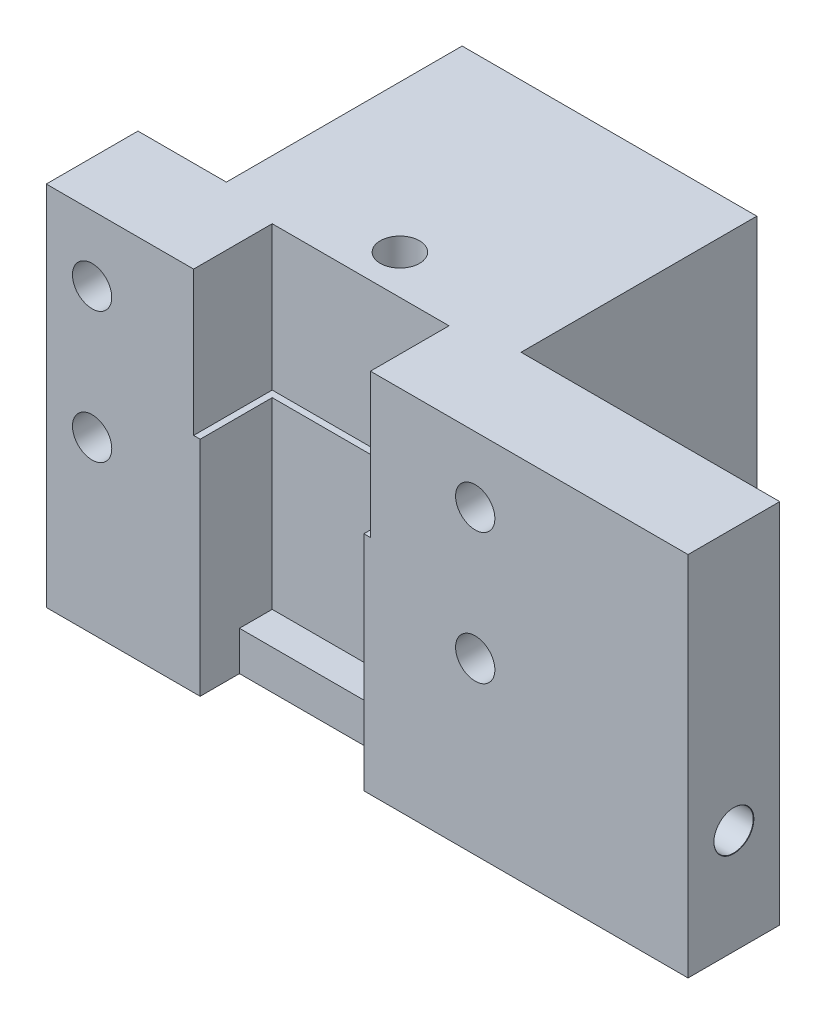
ISO-10303-21;
HEADER;
FILE_DESCRIPTION(('STEP AP214'),'2;1');
FILE_NAME('part.step','',(''),(''),'','','');
FILE_SCHEMA(('AUTOMOTIVE_DESIGN { 1 0 10303 214 1 1 1 1 }'));
ENDSEC;
DATA;
#1=APPLICATION_CONTEXT('core data for automotive mechanical design processes');
#2=APPLICATION_PROTOCOL_DEFINITION('international standard','automotive_design',2000,#1);
#3=PRODUCT_CONTEXT('',#1,'mechanical');
#4=PRODUCT('Part','Part','',(#3));
#5=PRODUCT_RELATED_PRODUCT_CATEGORY('part','',(#4));
#6=PRODUCT_DEFINITION_FORMATION('','',#4);
#7=PRODUCT_DEFINITION_CONTEXT('part definition',#1,'design');
#8=PRODUCT_DEFINITION('design','',#6,#7);
#9=PRODUCT_DEFINITION_SHAPE('','',#8);
#10=(LENGTH_UNIT() NAMED_UNIT(*) SI_UNIT(.MILLI.,.METRE.));
#11=(NAMED_UNIT(*) PLANE_ANGLE_UNIT() SI_UNIT($,.RADIAN.));
#12=(NAMED_UNIT(*) SI_UNIT($,.STERADIAN.) SOLID_ANGLE_UNIT());
#13=UNCERTAINTY_MEASURE_WITH_UNIT(LENGTH_MEASURE(1.E-05),#10,'distance_accuracy_value','');
#14=(GEOMETRIC_REPRESENTATION_CONTEXT(3) GLOBAL_UNCERTAINTY_ASSIGNED_CONTEXT((#13)) GLOBAL_UNIT_ASSIGNED_CONTEXT((#10,
#11,#12)) REPRESENTATION_CONTEXT('',''));
#15=CARTESIAN_POINT('',(0.,0.,0.));
#16=DIRECTION('',(0.,0.,1.));
#17=DIRECTION('',(1.,0.,0.));
#18=AXIS2_PLACEMENT_3D('',#15,#16,#17);
#19=CARTESIAN_POINT('',(1.22442804428043,3.,12.690405904059));
#20=DIRECTION('',(-1.,0.,0.));
#21=DIRECTION('',(0.,0.,1.));
#22=AXIS2_PLACEMENT_3D('',#19,#20,#21);
#23=PLANE('',#22);
#24=DIRECTION('',(0.,0.,-1.));
#25=VECTOR('',#24,1.);
#26=CARTESIAN_POINT('',(1.22442804428043,17.,7.19040590405904));
#27=LINE('',#26,#25);
#28=CARTESIAN_POINT('',(1.22442804428043,17.,12.690405904059));
#29=VERTEX_POINT('',#28);
#30=CARTESIAN_POINT('',(1.22442804428043,17.,7.19040590405904));
#31=VERTEX_POINT('',#30);
#32=EDGE_CURVE('E433',#29,#31,#27,.T.);
#33=ORIENTED_EDGE('',*,*,#32,.F.);
#34=DIRECTION('',(0.,1.,0.));
#35=VECTOR('',#34,1.);
#36=CARTESIAN_POINT('',(1.22442804428043,3.,12.690405904059));
#37=LINE('',#36,#35);
#38=CARTESIAN_POINT('',(1.22442804428043,0.,12.690405904059));
#39=VERTEX_POINT('',#38);
#40=EDGE_CURVE('E347',#39,#29,#37,.T.);
#41=ORIENTED_EDGE('',*,*,#40,.F.);
#42=DIRECTION('',(0.,0.,1.));
#43=VECTOR('',#42,1.);
#44=CARTESIAN_POINT('',(1.22442804428043,0.,0.));
#45=LINE('',#44,#43);
#46=CARTESIAN_POINT('',(1.22442804428043,0.,9.69040590405904));
#47=VERTEX_POINT('',#46);
#48=EDGE_CURVE('E223',#47,#39,#45,.T.);
#49=ORIENTED_EDGE('',*,*,#48,.F.);
#50=DIRECTION('',(0.,1.,0.));
#51=VECTOR('',#50,1.);
#52=CARTESIAN_POINT('',(1.22442804428043,-7.,9.69040590405904));
#53=LINE('',#52,#51);
#54=CARTESIAN_POINT('',(1.22442804428043,3.,9.69040590405904));
#55=VERTEX_POINT('',#54);
#56=EDGE_CURVE('E210',#47,#55,#53,.T.);
#57=ORIENTED_EDGE('',*,*,#56,.T.);
#58=DIRECTION('',(0.,0.,1.));
#59=VECTOR('',#58,1.);
#60=CARTESIAN_POINT('',(1.22442804428043,3.,12.690405904059));
#61=LINE('',#60,#59);
#62=CARTESIAN_POINT('',(1.22442804428043,3.,7.19040590405904));
#63=VERTEX_POINT('',#62);
#64=EDGE_CURVE('E336',#63,#55,#61,.T.);
#65=ORIENTED_EDGE('',*,*,#64,.F.);
#66=DIRECTION('',(0.,1.,0.));
#67=VECTOR('',#66,1.);
#68=CARTESIAN_POINT('',(1.22442804428043,3.,7.19040590405904));
#69=LINE('',#68,#67);
#70=EDGE_CURVE('E348',#63,#31,#69,.T.);
#71=ORIENTED_EDGE('',*,*,#70,.T.);
#72=EDGE_LOOP('',(#33,#41,#49,#57,#65,#71));
#73=FACE_BOUND('',#72,.T.);
#74=ADVANCED_FACE('F39',(#73),#23,.F.);
#75=CARTESIAN_POINT('',(1.22442804428043,3.,7.19040590405904));
#76=DIRECTION('',(0.,0.,-1.));
#77=DIRECTION('',(-1.,0.,0.));
#78=AXIS2_PLACEMENT_3D('',#75,#76,#77);
#79=PLANE('',#78);
#80=DIRECTION('',(1.,0.,0.));
#81=VECTOR('',#80,1.);
#82=CARTESIAN_POINT('',(13.7244280442804,17.,7.19040590405904));
#83=LINE('',#82,#81);
#84=CARTESIAN_POINT('',(13.7244280442804,17.,7.19040590405904));
#85=VERTEX_POINT('',#84);
#86=EDGE_CURVE('E57',#31,#85,#83,.T.);
#87=ORIENTED_EDGE('',*,*,#86,.F.);
#88=ORIENTED_EDGE('',*,*,#70,.F.);
#89=DIRECTION('',(-1.,0.,0.));
#90=VECTOR('',#89,1.);
#91=CARTESIAN_POINT('',(1.22442804428043,3.,7.19040590405904));
#92=LINE('',#91,#90);
#93=CARTESIAN_POINT('',(13.7244280442804,3.,7.19040590405904));
#94=VERTEX_POINT('',#93);
#95=EDGE_CURVE('E343',#94,#63,#92,.T.);
#96=ORIENTED_EDGE('',*,*,#95,.F.);
#97=DIRECTION('',(0.,1.,0.));
#98=VECTOR('',#97,1.);
#99=CARTESIAN_POINT('',(13.7244280442804,3.,7.19040590405904));
#100=LINE('',#99,#98);
#101=EDGE_CURVE('E353',#94,#85,#100,.T.);
#102=ORIENTED_EDGE('',*,*,#101,.T.);
#103=EDGE_LOOP('',(#87,#88,#96,#102));
#104=FACE_BOUND('',#103,.T.);
#105=ADVANCED_FACE('F485',(#104),#79,.F.);
#106=CARTESIAN_POINT('',(13.7244280442804,3.,12.690405904059));
#107=DIRECTION('',(1.,0.,0.));
#108=DIRECTION('',(0.,0.,-1.));
#109=AXIS2_PLACEMENT_3D('',#106,#107,#108);
#110=PLANE('',#109);
#111=CARTESIAN_POINT('',(13.7244280442804,8.,9.19040590405903));
#112=DIRECTION('',(1.,0.,0.));
#113=DIRECTION('',(0.,0.,-1.));
#114=AXIS2_PLACEMENT_3D('',#111,#112,#113);
#115=CIRCLE('',#114,1.49999999999999);
#116=CARTESIAN_POINT('',(13.7244280442804,8.,7.69040590405903));
#117=VERTEX_POINT('',#116);
#118=EDGE_CURVE('E320',#117,#117,#115,.T.);
#119=ORIENTED_EDGE('',*,*,#118,.T.);
#120=EDGE_LOOP('',(#119));
#121=FACE_BOUND('',#120,.T.);
#122=DIRECTION('',(0.,0.,1.));
#123=VECTOR('',#122,1.);
#124=CARTESIAN_POINT('',(13.7244280442804,17.,12.690405904059));
#125=LINE('',#124,#123);
#126=CARTESIAN_POINT('',(13.7244280442804,17.,12.690405904059));
#127=VERTEX_POINT('',#126);
#128=EDGE_CURVE('E185',#85,#127,#125,.T.);
#129=ORIENTED_EDGE('',*,*,#128,.F.);
#130=ORIENTED_EDGE('',*,*,#101,.F.);
#131=DIRECTION('',(0.,0.,-1.));
#132=VECTOR('',#131,1.);
#133=CARTESIAN_POINT('',(13.7244280442804,3.,12.690405904059));
#134=LINE('',#133,#132);
#135=CARTESIAN_POINT('',(13.7244280442804,3.,9.69040590405904));
#136=VERTEX_POINT('',#135);
#137=EDGE_CURVE('E340',#136,#94,#134,.T.);
#138=ORIENTED_EDGE('',*,*,#137,.F.);
#139=DIRECTION('',(0.,1.,0.));
#140=VECTOR('',#139,1.);
#141=CARTESIAN_POINT('',(13.7244280442804,-7.,9.69040590405904));
#142=LINE('',#141,#140);
#143=CARTESIAN_POINT('',(13.7244280442804,0.,9.69040590405904));
#144=VERTEX_POINT('',#143);
#145=EDGE_CURVE('E208',#144,#136,#142,.T.);
#146=ORIENTED_EDGE('',*,*,#145,.F.);
#147=DIRECTION('',(0.,0.,-1.));
#148=VECTOR('',#147,1.);
#149=CARTESIAN_POINT('',(13.7244280442804,0.,0.));
#150=LINE('',#149,#148);
#151=CARTESIAN_POINT('',(13.7244280442804,0.,12.690405904059));
#152=VERTEX_POINT('',#151);
#153=EDGE_CURVE('E213',#152,#144,#150,.T.);
#154=ORIENTED_EDGE('',*,*,#153,.F.);
#155=DIRECTION('',(0.,1.,0.));
#156=VECTOR('',#155,1.);
#157=CARTESIAN_POINT('',(13.7244280442804,3.,12.690405904059));
#158=LINE('',#157,#156);
#159=EDGE_CURVE('E357',#152,#127,#158,.T.);
#160=ORIENTED_EDGE('',*,*,#159,.T.);
#161=EDGE_LOOP('',(#129,#130,#138,#146,#154,#160));
#162=FACE_BOUND('',#161,.T.);
#163=ADVANCED_FACE('F423',(#121,#162),#110,.F.);
#164=CARTESIAN_POINT('',(-10.5255719557196,28.,12.690405904059));
#165=DIRECTION('',(0.,0.,-1.));
#166=DIRECTION('',(-1.,0.,0.));
#167=AXIS2_PLACEMENT_3D('',#164,#165,#166);
#168=PLANE('',#167);
#169=CARTESIAN_POINT('',(-7.02557195571956,23.,12.690405904059));
#170=DIRECTION('',(0.,0.,1.));
#171=DIRECTION('',(1.,0.,0.));
#172=AXIS2_PLACEMENT_3D('',#169,#170,#171);
#173=CIRCLE('',#172,1.5);
#174=CARTESIAN_POINT('',(-5.52557195571956,23.,12.690405904059));
#175=VERTEX_POINT('',#174);
#176=EDGE_CURVE('E293',#175,#175,#173,.T.);
#177=ORIENTED_EDGE('',*,*,#176,.F.);
#178=EDGE_LOOP('',(#177));
#179=FACE_BOUND('',#178,.T.);
#180=CARTESIAN_POINT('',(-7.02557195571956,13.,12.690405904059));
#181=DIRECTION('',(0.,0.,1.));
#182=DIRECTION('',(1.,0.,0.));
#183=AXIS2_PLACEMENT_3D('',#180,#181,#182);
#184=CIRCLE('',#183,1.5);
#185=CARTESIAN_POINT('',(-5.52557195571956,13.,12.690405904059));
#186=VERTEX_POINT('',#185);
#187=EDGE_CURVE('E289',#186,#186,#184,.T.);
#188=ORIENTED_EDGE('',*,*,#187,.F.);
#189=EDGE_LOOP('',(#188));
#190=FACE_BOUND('',#189,.T.);
#191=DIRECTION('',(1.,0.,0.));
#192=VECTOR('',#191,1.);
#193=CARTESIAN_POINT('',(0.724428044280431,17.,12.690405904059));
#194=LINE('',#193,#192);
#195=CARTESIAN_POINT('',(0.724428044280431,17.,12.690405904059));
#196=VERTEX_POINT('',#195);
#197=EDGE_CURVE('E428',#196,#29,#194,.T.);
#198=ORIENTED_EDGE('',*,*,#197,.F.);
#199=DIRECTION('',(0.,1.,0.));
#200=VECTOR('',#199,1.);
#201=CARTESIAN_POINT('',(0.724428044280431,17.,12.690405904059));
#202=LINE('',#201,#200);
#203=CARTESIAN_POINT('',(0.724428044280431,28.,12.690405904059));
#204=VERTEX_POINT('',#203);
#205=EDGE_CURVE('E209',#196,#204,#202,.T.);
#206=ORIENTED_EDGE('',*,*,#205,.T.);
#207=DIRECTION('',(1.,0.,0.));
#208=VECTOR('',#207,1.);
#209=CARTESIAN_POINT('',(-10.5255719557196,28.,12.690405904059));
#210=LINE('',#209,#208);
#211=CARTESIAN_POINT('',(-10.5255719557196,28.,12.690405904059));
#212=VERTEX_POINT('',#211);
#213=EDGE_CURVE('E367',#212,#204,#210,.T.);
#214=ORIENTED_EDGE('',*,*,#213,.F.);
#215=DIRECTION('',(0.,-1.,0.));
#216=VECTOR('',#215,1.);
#217=CARTESIAN_POINT('',(-10.5255719557196,28.,12.690405904059));
#218=LINE('',#217,#216);
#219=CARTESIAN_POINT('',(-10.5255719557196,0.,12.690405904059));
#220=VERTEX_POINT('',#219);
#221=EDGE_CURVE('E11',#212,#220,#218,.T.);
#222=ORIENTED_EDGE('',*,*,#221,.T.);
#223=DIRECTION('',(1.,0.,0.));
#224=VECTOR('',#223,1.);
#225=CARTESIAN_POINT('',(-10.5255719557196,0.,12.690405904059));
#226=LINE('',#225,#224);
#227=EDGE_CURVE('E382',#220,#39,#226,.T.);
#228=ORIENTED_EDGE('',*,*,#227,.T.);
#229=ORIENTED_EDGE('',*,*,#40,.T.);
#230=EDGE_LOOP('',(#198,#206,#214,#222,#228,#229));
#231=FACE_BOUND('',#230,.T.);
#232=ADVANCED_FACE('F420',(#179,#190,#231),#168,.F.);
#233=CARTESIAN_POINT('',(-10.5255719557196,28.,-12.309594095941));
#234=DIRECTION('',(1.,0.,0.));
#235=DIRECTION('',(0.,0.,-1.));
#236=AXIS2_PLACEMENT_3D('',#233,#234,#235);
#237=PLANE('',#236);
#238=DIRECTION('',(0.,0.,1.));
#239=VECTOR('',#238,1.);
#240=CARTESIAN_POINT('',(-10.5255719557196,28.,-12.309594095941));
#241=LINE('',#240,#239);
#242=CARTESIAN_POINT('',(-10.5255719557196,28.,5.69040590405904));
#243=VERTEX_POINT('',#242);
#244=EDGE_CURVE('E363',#243,#212,#241,.T.);
#245=ORIENTED_EDGE('',*,*,#244,.F.);
#246=DIRECTION('',(0.,1.,0.));
#247=VECTOR('',#246,1.);
#248=CARTESIAN_POINT('',(-10.5255719557196,0.,5.69040590405904));
#249=LINE('',#248,#247);
#250=CARTESIAN_POINT('',(-10.5255719557196,0.,5.69040590405904));
#251=VERTEX_POINT('',#250);
#252=EDGE_CURVE('E235',#251,#243,#249,.T.);
#253=ORIENTED_EDGE('',*,*,#252,.F.);
#254=DIRECTION('',(0.,0.,1.));
#255=VECTOR('',#254,1.);
#256=CARTESIAN_POINT('',(-10.5255719557196,0.,-12.309594095941));
#257=LINE('',#256,#255);
#258=EDGE_CURVE('E352',#251,#220,#257,.T.);
#259=ORIENTED_EDGE('',*,*,#258,.T.);
#260=ORIENTED_EDGE('',*,*,#221,.F.);
#261=EDGE_LOOP('',(#245,#253,#259,#260));
#262=FACE_BOUND('',#261,.T.);
#263=ADVANCED_FACE('F41',(#262),#237,.F.);
#264=CARTESIAN_POINT('',(22.2244280442804,23.,12.690405904059));
#265=DIRECTION('',(0.,0.,1.));
#266=DIRECTION('',(1.,0.,0.));
#267=AXIS2_PLACEMENT_3D('',#264,#265,#266);
#268=CIRCLE('',#267,1.5);
#269=CARTESIAN_POINT('',(23.7244280442804,23.,12.690405904059));
#270=VERTEX_POINT('',#269);
#271=EDGE_CURVE('E288',#270,#270,#268,.T.);
#272=ORIENTED_EDGE('',*,*,#271,.F.);
#273=EDGE_LOOP('',(#272));
#274=FACE_BOUND('',#273,.T.);
#275=CARTESIAN_POINT('',(22.2244280442804,13.,12.690405904059));
#276=DIRECTION('',(0.,0.,1.));
#277=DIRECTION('',(1.,0.,0.));
#278=AXIS2_PLACEMENT_3D('',#275,#276,#277);
#279=CIRCLE('',#278,1.5);
#280=CARTESIAN_POINT('',(23.7244280442804,13.,12.690405904059));
#281=VERTEX_POINT('',#280);
#282=EDGE_CURVE('E284',#281,#281,#279,.T.);
#283=ORIENTED_EDGE('',*,*,#282,.F.);
#284=EDGE_LOOP('',(#283));
#285=FACE_BOUND('',#284,.T.);
#286=CARTESIAN_POINT('',(14.2244280442804,28.,12.690405904059));
#287=VERTEX_POINT('',#286);
#288=CARTESIAN_POINT('',(38.4744280442804,28.,12.690405904059));
#289=VERTEX_POINT('',#288);
#290=EDGE_CURVE('E194',#287,#289,#210,.T.);
#291=ORIENTED_EDGE('',*,*,#290,.F.);
#292=DIRECTION('',(0.,1.,0.));
#293=VECTOR('',#292,1.);
#294=CARTESIAN_POINT('',(14.2244280442804,17.,12.690405904059));
#295=LINE('',#294,#293);
#296=CARTESIAN_POINT('',(14.2244280442804,17.,12.690405904059));
#297=VERTEX_POINT('',#296);
#298=EDGE_CURVE('E174',#297,#287,#295,.T.);
#299=ORIENTED_EDGE('',*,*,#298,.F.);
#300=DIRECTION('',(1.,0.,0.));
#301=VECTOR('',#300,1.);
#302=CARTESIAN_POINT('',(13.7244280442804,17.,12.690405904059));
#303=LINE('',#302,#301);
#304=EDGE_CURVE('E181',#127,#297,#303,.T.);
#305=ORIENTED_EDGE('',*,*,#304,.F.);
#306=ORIENTED_EDGE('',*,*,#159,.F.);
#307=CARTESIAN_POINT('',(38.4744280442804,0.,12.690405904059));
#308=VERTEX_POINT('',#307);
#309=EDGE_CURVE('E381',#152,#308,#226,.T.);
#310=ORIENTED_EDGE('',*,*,#309,.T.);
#311=DIRECTION('',(0.,-1.,0.));
#312=VECTOR('',#311,1.);
#313=CARTESIAN_POINT('',(38.4744280442804,28.,12.690405904059));
#314=LINE('',#313,#312);
#315=EDGE_CURVE('E49',#289,#308,#314,.T.);
#316=ORIENTED_EDGE('',*,*,#315,.F.);
#317=EDGE_LOOP('',(#291,#299,#305,#306,#310,#316));
#318=FACE_BOUND('',#317,.T.);
#319=ADVANCED_FACE('F192',(#274,#285,#318),#168,.F.);
#320=CARTESIAN_POINT('',(38.4744280442804,28.,-12.309594095941));
#321=DIRECTION('',(-1.,0.,0.));
#322=DIRECTION('',(0.,0.,1.));
#323=AXIS2_PLACEMENT_3D('',#320,#321,#322);
#324=PLANE('',#323);
#325=CARTESIAN_POINT('',(38.4744280442804,8.,9.19040590405903));
#326=DIRECTION('',(1.,0.,0.));
#327=DIRECTION('',(0.,0.,-1.));
#328=AXIS2_PLACEMENT_3D('',#325,#326,#327);
#329=CIRCLE('',#328,1.525);
#330=CARTESIAN_POINT('',(38.4744280442804,8.,7.66540590405903));
#331=VERTEX_POINT('',#330);
#332=EDGE_CURVE('E312',#331,#331,#329,.T.);
#333=ORIENTED_EDGE('',*,*,#332,.F.);
#334=EDGE_LOOP('',(#333));
#335=FACE_BOUND('',#334,.T.);
#336=DIRECTION('',(0.,0.,-1.));
#337=VECTOR('',#336,1.);
#338=CARTESIAN_POINT('',(38.4744280442804,0.,-12.309594095941));
#339=LINE('',#338,#337);
#340=CARTESIAN_POINT('',(38.4744280442804,0.,5.69040590405904));
#341=VERTEX_POINT('',#340);
#342=EDGE_CURVE('E386',#308,#341,#339,.T.);
#343=ORIENTED_EDGE('',*,*,#342,.T.);
#344=DIRECTION('',(0.,1.,0.));
#345=VECTOR('',#344,1.);
#346=CARTESIAN_POINT('',(38.4744280442804,0.,5.69040590405904));
#347=LINE('',#346,#345);
#348=CARTESIAN_POINT('',(38.4744280442804,28.,5.69040590405904));
#349=VERTEX_POINT('',#348);
#350=EDGE_CURVE('E270',#341,#349,#347,.T.);
#351=ORIENTED_EDGE('',*,*,#350,.T.);
#352=DIRECTION('',(0.,0.,-1.));
#353=VECTOR('',#352,1.);
#354=CARTESIAN_POINT('',(38.4744280442804,28.,-12.309594095941));
#355=LINE('',#354,#353);
#356=EDGE_CURVE('E371',#289,#349,#355,.T.);
#357=ORIENTED_EDGE('',*,*,#356,.F.);
#358=ORIENTED_EDGE('',*,*,#315,.T.);
#359=EDGE_LOOP('',(#343,#351,#357,#358));
#360=FACE_BOUND('',#359,.T.);
#361=ADVANCED_FACE('F494',(#335,#360),#324,.F.);
#362=CARTESIAN_POINT('',(-10.5255719557196,28.,-12.309594095941));
#363=DIRECTION('',(0.,0.,1.));
#364=DIRECTION('',(1.,0.,0.));
#365=AXIS2_PLACEMENT_3D('',#362,#363,#364);
#366=PLANE('',#365);
#367=CARTESIAN_POINT('',(7.47442804428044,16.,-12.309594095941));
#368=DIRECTION('',(0.,0.,-1.));
#369=DIRECTION('',(-1.,0.,0.));
#370=AXIS2_PLACEMENT_3D('',#367,#368,#369);
#371=CIRCLE('',#370,1.525);
#372=CARTESIAN_POINT('',(5.94942804428044,16.,-12.309594095941));
#373=VERTEX_POINT('',#372);
#374=EDGE_CURVE('E324',#373,#373,#371,.T.);
#375=ORIENTED_EDGE('',*,*,#374,.F.);
#376=EDGE_LOOP('',(#375));
#377=FACE_BOUND('',#376,.T.);
#378=DIRECTION('',(-1.,0.,0.));
#379=VECTOR('',#378,1.);
#380=CARTESIAN_POINT('',(-10.5255719557196,0.,-12.309594095941));
#381=LINE('',#380,#379);
#382=CARTESIAN_POINT('',(18.7244280442804,0.,-12.309594095941));
#383=VERTEX_POINT('',#382);
#384=CARTESIAN_POINT('',(-3.77557195571957,0.,-12.309594095941));
#385=VERTEX_POINT('',#384);
#386=EDGE_CURVE('E366',#383,#385,#381,.T.);
#387=ORIENTED_EDGE('',*,*,#386,.T.);
#388=DIRECTION('',(0.,1.,0.));
#389=VECTOR('',#388,1.);
#390=CARTESIAN_POINT('',(-3.77557195571957,0.,-12.309594095941));
#391=LINE('',#390,#389);
#392=CARTESIAN_POINT('',(-3.77557195571957,28.,-12.309594095941));
#393=VERTEX_POINT('',#392);
#394=EDGE_CURVE('E243',#385,#393,#391,.T.);
#395=ORIENTED_EDGE('',*,*,#394,.T.);
#396=DIRECTION('',(-1.,0.,0.));
#397=VECTOR('',#396,1.);
#398=CARTESIAN_POINT('',(-10.5255719557196,28.,-12.309594095941));
#399=LINE('',#398,#397);
#400=CARTESIAN_POINT('',(18.7244280442804,28.,-12.309594095941));
#401=VERTEX_POINT('',#400);
#402=EDGE_CURVE('E375',#401,#393,#399,.T.);
#403=ORIENTED_EDGE('',*,*,#402,.F.);
#404=DIRECTION('',(0.,1.,0.));
#405=VECTOR('',#404,1.);
#406=CARTESIAN_POINT('',(18.7244280442804,0.,-12.309594095941));
#407=LINE('',#406,#405);
#408=EDGE_CURVE('E240',#383,#401,#407,.T.);
#409=ORIENTED_EDGE('',*,*,#408,.F.);
#410=EDGE_LOOP('',(#387,#395,#403,#409));
#411=FACE_BOUND('',#410,.T.);
#412=ADVANCED_FACE('F530',(#377,#411),#366,.F.);
#413=CARTESIAN_POINT('',(0.,28.,0.));
#414=DIRECTION('',(0.,1.,0.));
#415=DIRECTION('',(0.,0.,1.));
#416=AXIS2_PLACEMENT_3D('',#413,#414,#415);
#417=PLANE('',#416);
#418=DIRECTION('',(0.,0.,1.));
#419=VECTOR('',#418,1.);
#420=CARTESIAN_POINT('',(0.724428044280431,28.,6.69040590405904));
#421=LINE('',#420,#419);
#422=CARTESIAN_POINT('',(0.724428044280431,28.,6.69040590405904));
#423=VERTEX_POINT('',#422);
#424=EDGE_CURVE('E189',#423,#204,#421,.T.);
#425=ORIENTED_EDGE('',*,*,#424,.F.);
#426=DIRECTION('',(-1.,0.,0.));
#427=VECTOR('',#426,1.);
#428=CARTESIAN_POINT('',(14.2244280442804,28.,6.69040590405904));
#429=LINE('',#428,#427);
#430=CARTESIAN_POINT('',(14.2244280442804,28.,6.69040590405904));
#431=VERTEX_POINT('',#430);
#432=EDGE_CURVE('E447',#431,#423,#429,.T.);
#433=ORIENTED_EDGE('',*,*,#432,.F.);
#434=DIRECTION('',(0.,0.,-1.));
#435=VECTOR('',#434,1.);
#436=CARTESIAN_POINT('',(14.2244280442804,28.,12.690405904059));
#437=LINE('',#436,#435);
#438=EDGE_CURVE('E444',#287,#431,#437,.T.);
#439=ORIENTED_EDGE('',*,*,#438,.F.);
#440=ORIENTED_EDGE('',*,*,#290,.T.);
#441=ORIENTED_EDGE('',*,*,#356,.T.);
#442=DIRECTION('',(1.,0.,0.));
#443=VECTOR('',#442,1.);
#444=CARTESIAN_POINT('',(18.7244280442804,28.,5.69040590405904));
#445=LINE('',#444,#443);
#446=CARTESIAN_POINT('',(18.7244280442804,28.,5.69040590405904));
#447=VERTEX_POINT('',#446);
#448=EDGE_CURVE('E258',#447,#349,#445,.T.);
#449=ORIENTED_EDGE('',*,*,#448,.F.);
#450=DIRECTION('',(0.,0.,1.));
#451=VECTOR('',#450,1.);
#452=CARTESIAN_POINT('',(18.7244280442804,28.,-12.309594095941));
#453=LINE('',#452,#451);
#454=EDGE_CURVE('E227',#401,#447,#453,.T.);
#455=ORIENTED_EDGE('',*,*,#454,.F.);
#456=ORIENTED_EDGE('',*,*,#402,.T.);
#457=DIRECTION('',(0.,0.,-1.));
#458=VECTOR('',#457,1.);
#459=CARTESIAN_POINT('',(-3.77557195571957,28.,-12.309594095941));
#460=LINE('',#459,#458);
#461=CARTESIAN_POINT('',(-3.77557195571957,28.,5.69040590405904));
#462=VERTEX_POINT('',#461);
#463=EDGE_CURVE('E232',#462,#393,#460,.T.);
#464=ORIENTED_EDGE('',*,*,#463,.F.);
#465=DIRECTION('',(1.,0.,0.));
#466=VECTOR('',#465,1.);
#467=CARTESIAN_POINT('',(-10.5255719557196,28.,5.69040590405904));
#468=LINE('',#467,#466);
#469=EDGE_CURVE('E236',#243,#462,#468,.T.);
#470=ORIENTED_EDGE('',*,*,#469,.F.);
#471=ORIENTED_EDGE('',*,*,#244,.T.);
#472=ORIENTED_EDGE('',*,*,#213,.T.);
#473=EDGE_LOOP('',(#425,#433,#439,#440,#441,#449,#455,#456,#464,#470,#471,#472));
#474=FACE_BOUND('',#473,.T.);
#475=CARTESIAN_POINT('',(7.47442804428044,28.,3.69040590405904));
#476=DIRECTION('',(0.,-1.,0.));
#477=DIRECTION('',(0.,0.,-1.));
#478=AXIS2_PLACEMENT_3D('',#475,#476,#477);
#479=CIRCLE('',#478,1.49999999999999);
#480=CARTESIAN_POINT('',(7.47442804428044,28.,2.19040590405905));
#481=VERTEX_POINT('',#480);
#482=EDGE_CURVE('E308',#481,#481,#479,.T.);
#483=ORIENTED_EDGE('',*,*,#482,.T.);
#484=EDGE_LOOP('',(#483));
#485=FACE_BOUND('',#484,.T.);
#486=ADVANCED_FACE('F463',(#474,#485),#417,.T.);
#487=CARTESIAN_POINT('',(0.,0.,0.));
#488=DIRECTION('',(0.,1.,0.));
#489=DIRECTION('',(0.,0.,1.));
#490=AXIS2_PLACEMENT_3D('',#487,#488,#489);
#491=PLANE('',#490);
#492=CARTESIAN_POINT('',(7.47442804428044,0.,3.69040590405904));
#493=DIRECTION('',(0.,-1.,0.));
#494=DIRECTION('',(0.,0.,-1.));
#495=AXIS2_PLACEMENT_3D('',#492,#493,#494);
#496=CIRCLE('',#495,1.525);
#497=CARTESIAN_POINT('',(7.47442804428044,0.,2.16540590405904));
#498=VERTEX_POINT('',#497);
#499=EDGE_CURVE('E300',#498,#498,#496,.T.);
#500=ORIENTED_EDGE('',*,*,#499,.F.);
#501=EDGE_LOOP('',(#500));
#502=FACE_BOUND('',#501,.T.);
#503=DIRECTION('',(-1.,0.,0.));
#504=VECTOR('',#503,1.);
#505=CARTESIAN_POINT('',(0.,0.,9.69040590405904));
#506=LINE('',#505,#504);
#507=EDGE_CURVE('E219',#144,#47,#506,.T.);
#508=ORIENTED_EDGE('',*,*,#507,.T.);
#509=ORIENTED_EDGE('',*,*,#48,.T.);
#510=ORIENTED_EDGE('',*,*,#227,.F.);
#511=ORIENTED_EDGE('',*,*,#258,.F.);
#512=DIRECTION('',(1.,0.,0.));
#513=VECTOR('',#512,1.);
#514=CARTESIAN_POINT('',(-10.5255719557196,0.,5.69040590405904));
#515=LINE('',#514,#513);
#516=CARTESIAN_POINT('',(-3.77557195571957,0.,5.69040590405904));
#517=VERTEX_POINT('',#516);
#518=EDGE_CURVE('E228',#251,#517,#515,.T.);
#519=ORIENTED_EDGE('',*,*,#518,.T.);
#520=DIRECTION('',(0.,0.,-1.));
#521=VECTOR('',#520,1.);
#522=CARTESIAN_POINT('',(-3.77557195571957,0.,-12.309594095941));
#523=LINE('',#522,#521);
#524=EDGE_CURVE('E65',#517,#385,#523,.T.);
#525=ORIENTED_EDGE('',*,*,#524,.T.);
#526=ORIENTED_EDGE('',*,*,#386,.F.);
#527=DIRECTION('',(0.,0.,1.));
#528=VECTOR('',#527,1.);
#529=CARTESIAN_POINT('',(18.7244280442804,0.,-12.309594095941));
#530=LINE('',#529,#528);
#531=CARTESIAN_POINT('',(18.7244280442804,0.,5.69040590405904));
#532=VERTEX_POINT('',#531);
#533=EDGE_CURVE('E253',#383,#532,#530,.T.);
#534=ORIENTED_EDGE('',*,*,#533,.T.);
#535=DIRECTION('',(1.,0.,0.));
#536=VECTOR('',#535,1.);
#537=CARTESIAN_POINT('',(18.7244280442804,0.,5.69040590405904));
#538=LINE('',#537,#536);
#539=EDGE_CURVE('E257',#532,#341,#538,.T.);
#540=ORIENTED_EDGE('',*,*,#539,.T.);
#541=ORIENTED_EDGE('',*,*,#342,.F.);
#542=ORIENTED_EDGE('',*,*,#309,.F.);
#543=ORIENTED_EDGE('',*,*,#153,.T.);
#544=EDGE_LOOP('',(#508,#509,#510,#511,#519,#525,#526,#534,#540,#541,#542,#543));
#545=FACE_BOUND('',#544,.T.);
#546=ADVANCED_FACE('F472',(#502,#545),#491,.F.);
#547=CARTESIAN_POINT('',(0.,3.,0.));
#548=DIRECTION('',(0.,-1.,0.));
#549=DIRECTION('',(0.,0.,-1.));
#550=AXIS2_PLACEMENT_3D('',#547,#548,#549);
#551=PLANE('',#550);
#552=ORIENTED_EDGE('',*,*,#64,.T.);
#553=DIRECTION('',(-1.,0.,0.));
#554=VECTOR('',#553,1.);
#555=CARTESIAN_POINT('',(1.22442804428043,3.,9.69040590405904));
#556=LINE('',#555,#554);
#557=EDGE_CURVE('E204',#136,#55,#556,.T.);
#558=ORIENTED_EDGE('',*,*,#557,.F.);
#559=ORIENTED_EDGE('',*,*,#137,.T.);
#560=ORIENTED_EDGE('',*,*,#95,.T.);
#561=EDGE_LOOP('',(#552,#558,#559,#560));
#562=FACE_BOUND('',#561,.T.);
#563=ADVANCED_FACE('F482',(#562),#551,.F.);
#564=CARTESIAN_POINT('',(7.47442804428044,16.,-1.2108850244823));
#565=DIRECTION('',(0.,0.,-1.));
#566=DIRECTION('',(-1.,0.,0.));
#567=AXIS2_PLACEMENT_3D('',#564,#565,#566);
#568=CONICAL_SURFACE('',#567,1.5,1.02974425867665);
#569=CARTESIAN_POINT('',(7.47442804428043,16.,-0.309594095940962));
#570=VERTEX_POINT('',#569);
#571=VERTEX_LOOP('',#570);
#572=FACE_BOUND('',#571,.T.);
#573=CARTESIAN_POINT('',(7.47442804428044,16.,-1.2108850244823));
#574=DIRECTION('',(0.,0.,-1.));
#575=DIRECTION('',(-1.,0.,0.));
#576=AXIS2_PLACEMENT_3D('',#573,#574,#575);
#577=CIRCLE('',#576,1.5);
#578=CARTESIAN_POINT('',(5.97442804428044,16.,-1.2108850244823));
#579=VERTEX_POINT('',#578);
#580=EDGE_CURVE('E332',#579,#579,#577,.T.);
#581=ORIENTED_EDGE('',*,*,#580,.T.);
#582=EDGE_LOOP('',(#581));
#583=FACE_BOUND('',#582,.T.);
#584=ADVANCED_FACE('F580',(#572,#583),#568,.F.);
#585=CARTESIAN_POINT('',(7.47442804428044,16.,-12.309594095941));
#586=DIRECTION('',(0.,0.,-1.));
#587=DIRECTION('',(-1.,0.,0.));
#588=AXIS2_PLACEMENT_3D('',#585,#586,#587);
#589=CYLINDRICAL_SURFACE('',#588,1.49999999999999);
#590=ORIENTED_EDGE('',*,*,#580,.F.);
#591=EDGE_LOOP('',(#590));
#592=FACE_BOUND('',#591,.T.);
#593=CARTESIAN_POINT('',(7.47442804428044,16.,-12.284594095941));
#594=DIRECTION('',(0.,0.,-1.));
#595=DIRECTION('',(-1.,0.,0.));
#596=AXIS2_PLACEMENT_3D('',#593,#594,#595);
#597=CIRCLE('',#596,1.49999999999999);
#598=CARTESIAN_POINT('',(5.97442804428045,16.,-12.284594095941));
#599=VERTEX_POINT('',#598);
#600=EDGE_CURVE('E328',#599,#599,#597,.T.);
#601=ORIENTED_EDGE('',*,*,#600,.T.);
#602=EDGE_LOOP('',(#601));
#603=FACE_BOUND('',#602,.T.);
#604=ADVANCED_FACE('F576',(#592,#603),#589,.F.);
#605=CARTESIAN_POINT('',(7.47442804428044,16.,-12.309594095941));
#606=DIRECTION('',(0.,0.,-1.));
#607=DIRECTION('',(-1.,0.,0.));
#608=AXIS2_PLACEMENT_3D('',#605,#606,#607);
#609=CONICAL_SURFACE('',#608,1.525,0.785398163397414);
#610=ORIENTED_EDGE('',*,*,#600,.F.);
#611=EDGE_LOOP('',(#610));
#612=FACE_BOUND('',#611,.T.);
#613=ORIENTED_EDGE('',*,*,#374,.T.);
#614=EDGE_LOOP('',(#613));
#615=FACE_BOUND('',#614,.T.);
#616=ADVANCED_FACE('F572',(#612,#615),#609,.F.);
#617=CARTESIAN_POINT('',(38.4744280442804,8.,9.19040590405903));
#618=DIRECTION('',(1.,0.,0.));
#619=DIRECTION('',(0.,0.,-1.));
#620=AXIS2_PLACEMENT_3D('',#617,#618,#619);
#621=CYLINDRICAL_SURFACE('',#620,1.49999999999999);
#622=ORIENTED_EDGE('',*,*,#118,.F.);
#623=EDGE_LOOP('',(#622));
#624=FACE_BOUND('',#623,.T.);
#625=CARTESIAN_POINT('',(38.4494280442804,8.,9.19040590405903));
#626=DIRECTION('',(1.,0.,0.));
#627=DIRECTION('',(0.,0.,-1.));
#628=AXIS2_PLACEMENT_3D('',#625,#626,#627);
#629=CIRCLE('',#628,1.49999999999999);
#630=CARTESIAN_POINT('',(38.4494280442804,8.,7.69040590405904));
#631=VERTEX_POINT('',#630);
#632=EDGE_CURVE('E316',#631,#631,#629,.T.);
#633=ORIENTED_EDGE('',*,*,#632,.T.);
#634=EDGE_LOOP('',(#633));
#635=FACE_BOUND('',#634,.T.);
#636=ADVANCED_FACE('F568',(#624,#635),#621,.F.);
#637=CARTESIAN_POINT('',(38.4744280442804,8.,9.19040590405903));
#638=DIRECTION('',(1.,0.,0.));
#639=DIRECTION('',(0.,0.,-1.));
#640=AXIS2_PLACEMENT_3D('',#637,#638,#639);
#641=CONICAL_SURFACE('',#640,1.525,0.78539816339776);
#642=ORIENTED_EDGE('',*,*,#632,.F.);
#643=EDGE_LOOP('',(#642));
#644=FACE_BOUND('',#643,.T.);
#645=ORIENTED_EDGE('',*,*,#332,.T.);
#646=EDGE_LOOP('',(#645));
#647=FACE_BOUND('',#646,.T.);
#648=ADVANCED_FACE('F564',(#644,#647),#641,.F.);
#649=CARTESIAN_POINT('',(7.47442804428044,0.,3.69040590405904));
#650=DIRECTION('',(0.,-1.,0.));
#651=DIRECTION('',(0.,0.,-1.));
#652=AXIS2_PLACEMENT_3D('',#649,#650,#651);
#653=CYLINDRICAL_SURFACE('',#652,1.49999999999999);
#654=ORIENTED_EDGE('',*,*,#482,.F.);
#655=EDGE_LOOP('',(#654));
#656=FACE_BOUND('',#655,.T.);
#657=CARTESIAN_POINT('',(7.47442804428044,0.0249999999999972,3.69040590405904));
#658=DIRECTION('',(0.,-1.,0.));
#659=DIRECTION('',(0.,0.,-1.));
#660=AXIS2_PLACEMENT_3D('',#657,#658,#659);
#661=CIRCLE('',#660,1.49999999999999);
#662=CARTESIAN_POINT('',(7.47442804428044,0.0249999999999972,2.19040590405905));
#663=VERTEX_POINT('',#662);
#664=EDGE_CURVE('E304',#663,#663,#661,.T.);
#665=ORIENTED_EDGE('',*,*,#664,.T.);
#666=EDGE_LOOP('',(#665));
#667=FACE_BOUND('',#666,.T.);
#668=ADVANCED_FACE('F560',(#656,#667),#653,.F.);
#669=CARTESIAN_POINT('',(7.47442804428044,0.,3.69040590405904));
#670=DIRECTION('',(0.,-1.,0.));
#671=DIRECTION('',(0.,0.,-1.));
#672=AXIS2_PLACEMENT_3D('',#669,#670,#671);
#673=CONICAL_SURFACE('',#672,1.525,0.785398163397726);
#674=ORIENTED_EDGE('',*,*,#664,.F.);
#675=EDGE_LOOP('',(#674));
#676=FACE_BOUND('',#675,.T.);
#677=ORIENTED_EDGE('',*,*,#499,.T.);
#678=EDGE_LOOP('',(#677));
#679=FACE_BOUND('',#678,.T.);
#680=ADVANCED_FACE('F416',(#676,#679),#673,.F.);
#681=CARTESIAN_POINT('',(-7.02557195571956,23.,0.690405904059039));
#682=DIRECTION('',(0.,0.,1.));
#683=DIRECTION('',(1.,0.,0.));
#684=AXIS2_PLACEMENT_3D('',#681,#682,#683);
#685=CYLINDRICAL_SURFACE('',#684,1.5);
#686=CARTESIAN_POINT('',(-7.02557195571956,23.,5.69040590405904));
#687=DIRECTION('',(0.,0.,1.));
#688=DIRECTION('',(1.,0.,0.));
#689=AXIS2_PLACEMENT_3D('',#686,#687,#688);
#690=CIRCLE('',#689,1.5);
#691=CARTESIAN_POINT('',(-5.52557195571956,23.,5.69040590405904));
#692=VERTEX_POINT('',#691);
#693=EDGE_CURVE('E276',#692,#692,#690,.F.);
#694=ORIENTED_EDGE('',*,*,#693,.T.);
#695=EDGE_LOOP('',(#694));
#696=FACE_BOUND('',#695,.T.);
#697=ORIENTED_EDGE('',*,*,#176,.T.);
#698=EDGE_LOOP('',(#697));
#699=FACE_BOUND('',#698,.T.);
#700=ADVANCED_FACE('F412',(#696,#699),#685,.F.);
#701=CARTESIAN_POINT('',(22.2244280442804,13.,0.690405904059039));
#702=DIRECTION('',(0.,0.,1.));
#703=DIRECTION('',(1.,0.,0.));
#704=AXIS2_PLACEMENT_3D('',#701,#702,#703);
#705=CYLINDRICAL_SURFACE('',#704,1.5);
#706=CARTESIAN_POINT('',(22.2244280442804,13.,5.69040590405904));
#707=DIRECTION('',(0.,0.,1.));
#708=DIRECTION('',(1.,0.,0.));
#709=AXIS2_PLACEMENT_3D('',#706,#707,#708);
#710=CIRCLE('',#709,1.5);
#711=CARTESIAN_POINT('',(23.7244280442804,13.,5.69040590405904));
#712=VERTEX_POINT('',#711);
#713=EDGE_CURVE('E280',#712,#712,#710,.F.);
#714=ORIENTED_EDGE('',*,*,#713,.T.);
#715=EDGE_LOOP('',(#714));
#716=FACE_BOUND('',#715,.T.);
#717=ORIENTED_EDGE('',*,*,#282,.T.);
#718=EDGE_LOOP('',(#717));
#719=FACE_BOUND('',#718,.T.);
#720=ADVANCED_FACE('F415',(#716,#719),#705,.F.);
#721=CARTESIAN_POINT('',(22.2244280442804,23.,0.690405904059039));
#722=DIRECTION('',(0.,0.,1.));
#723=DIRECTION('',(1.,0.,0.));
#724=AXIS2_PLACEMENT_3D('',#721,#722,#723);
#725=CYLINDRICAL_SURFACE('',#724,1.5);
#726=CARTESIAN_POINT('',(22.2244280442804,23.,5.69040590405904));
#727=DIRECTION('',(0.,0.,1.));
#728=DIRECTION('',(1.,0.,0.));
#729=AXIS2_PLACEMENT_3D('',#726,#727,#728);
#730=CIRCLE('',#729,1.5);
#731=CARTESIAN_POINT('',(23.7244280442804,23.,5.69040590405904));
#732=VERTEX_POINT('',#731);
#733=EDGE_CURVE('E43',#732,#732,#730,.F.);
#734=ORIENTED_EDGE('',*,*,#733,.T.);
#735=EDGE_LOOP('',(#734));
#736=FACE_BOUND('',#735,.T.);
#737=ORIENTED_EDGE('',*,*,#271,.T.);
#738=EDGE_LOOP('',(#737));
#739=FACE_BOUND('',#738,.T.);
#740=ADVANCED_FACE('F507',(#736,#739),#725,.F.);
#741=CARTESIAN_POINT('',(-7.02557195571956,13.,0.690405904059039));
#742=DIRECTION('',(0.,0.,1.));
#743=DIRECTION('',(1.,0.,0.));
#744=AXIS2_PLACEMENT_3D('',#741,#742,#743);
#745=CYLINDRICAL_SURFACE('',#744,1.5);
#746=CARTESIAN_POINT('',(-7.02557195571956,13.,5.69040590405904));
#747=DIRECTION('',(0.,0.,1.));
#748=DIRECTION('',(1.,0.,0.));
#749=AXIS2_PLACEMENT_3D('',#746,#747,#748);
#750=CIRCLE('',#749,1.5);
#751=CARTESIAN_POINT('',(-5.52557195571956,13.,5.69040590405904));
#752=VERTEX_POINT('',#751);
#753=EDGE_CURVE('E247',#752,#752,#750,.F.);
#754=ORIENTED_EDGE('',*,*,#753,.T.);
#755=EDGE_LOOP('',(#754));
#756=FACE_BOUND('',#755,.T.);
#757=ORIENTED_EDGE('',*,*,#187,.T.);
#758=EDGE_LOOP('',(#757));
#759=FACE_BOUND('',#758,.T.);
#760=ADVANCED_FACE('F399',(#756,#759),#745,.F.);
#761=CARTESIAN_POINT('',(-10.5255719557196,0.,5.69040590405904));
#762=DIRECTION('',(0.,0.,1.));
#763=DIRECTION('',(1.,0.,0.));
#764=AXIS2_PLACEMENT_3D('',#761,#762,#763);
#765=PLANE('',#764);
#766=ORIENTED_EDGE('',*,*,#753,.F.);
#767=EDGE_LOOP('',(#766));
#768=FACE_BOUND('',#767,.T.);
#769=ORIENTED_EDGE('',*,*,#469,.T.);
#770=DIRECTION('',(0.,1.,0.));
#771=VECTOR('',#770,1.);
#772=CARTESIAN_POINT('',(-3.77557195571957,0.,5.69040590405904));
#773=LINE('',#772,#771);
#774=EDGE_CURVE('E248',#517,#462,#773,.T.);
#775=ORIENTED_EDGE('',*,*,#774,.F.);
#776=ORIENTED_EDGE('',*,*,#518,.F.);
#777=ORIENTED_EDGE('',*,*,#252,.T.);
#778=EDGE_LOOP('',(#769,#775,#776,#777));
#779=FACE_BOUND('',#778,.T.);
#780=ORIENTED_EDGE('',*,*,#693,.F.);
#781=EDGE_LOOP('',(#780));
#782=FACE_BOUND('',#781,.T.);
#783=ADVANCED_FACE('F402',(#768,#779,#782),#765,.F.);
#784=CARTESIAN_POINT('',(-3.77557195571957,0.,-12.309594095941));
#785=DIRECTION('',(1.,0.,0.));
#786=DIRECTION('',(0.,0.,-1.));
#787=AXIS2_PLACEMENT_3D('',#784,#785,#786);
#788=PLANE('',#787);
#789=ORIENTED_EDGE('',*,*,#463,.T.);
#790=ORIENTED_EDGE('',*,*,#394,.F.);
#791=ORIENTED_EDGE('',*,*,#524,.F.);
#792=ORIENTED_EDGE('',*,*,#774,.T.);
#793=EDGE_LOOP('',(#789,#790,#791,#792));
#794=FACE_BOUND('',#793,.T.);
#795=ADVANCED_FACE('F405',(#794),#788,.F.);
#796=CARTESIAN_POINT('',(18.7244280442804,0.,5.69040590405904));
#797=DIRECTION('',(0.,0.,1.));
#798=DIRECTION('',(1.,0.,0.));
#799=AXIS2_PLACEMENT_3D('',#796,#797,#798);
#800=PLANE('',#799);
#801=ORIENTED_EDGE('',*,*,#733,.F.);
#802=EDGE_LOOP('',(#801));
#803=FACE_BOUND('',#802,.T.);
#804=ORIENTED_EDGE('',*,*,#448,.T.);
#805=ORIENTED_EDGE('',*,*,#350,.F.);
#806=ORIENTED_EDGE('',*,*,#539,.F.);
#807=DIRECTION('',(0.,1.,0.));
#808=VECTOR('',#807,1.);
#809=CARTESIAN_POINT('',(18.7244280442804,0.,5.69040590405904));
#810=LINE('',#809,#808);
#811=EDGE_CURVE('E262',#532,#447,#810,.T.);
#812=ORIENTED_EDGE('',*,*,#811,.T.);
#813=EDGE_LOOP('',(#804,#805,#806,#812));
#814=FACE_BOUND('',#813,.T.);
#815=ORIENTED_EDGE('',*,*,#713,.F.);
#816=EDGE_LOOP('',(#815));
#817=FACE_BOUND('',#816,.T.);
#818=ADVANCED_FACE('F498',(#803,#814,#817),#800,.F.);
#819=CARTESIAN_POINT('',(18.7244280442804,0.,-12.309594095941));
#820=DIRECTION('',(-1.,0.,0.));
#821=DIRECTION('',(0.,0.,1.));
#822=AXIS2_PLACEMENT_3D('',#819,#820,#821);
#823=PLANE('',#822);
#824=ORIENTED_EDGE('',*,*,#454,.T.);
#825=ORIENTED_EDGE('',*,*,#811,.F.);
#826=ORIENTED_EDGE('',*,*,#533,.F.);
#827=ORIENTED_EDGE('',*,*,#408,.T.);
#828=EDGE_LOOP('',(#824,#825,#826,#827));
#829=FACE_BOUND('',#828,.T.);
#830=ADVANCED_FACE('F511',(#829),#823,.F.);
#831=CARTESIAN_POINT('',(1.22442804428043,-7.,9.69040590405904));
#832=DIRECTION('',(0.,0.,-1.));
#833=DIRECTION('',(-1.,0.,0.));
#834=AXIS2_PLACEMENT_3D('',#831,#832,#833);
#835=PLANE('',#834);
#836=ORIENTED_EDGE('',*,*,#145,.T.);
#837=ORIENTED_EDGE('',*,*,#557,.T.);
#838=ORIENTED_EDGE('',*,*,#56,.F.);
#839=ORIENTED_EDGE('',*,*,#507,.F.);
#840=EDGE_LOOP('',(#836,#837,#838,#839));
#841=FACE_BOUND('',#840,.T.);
#842=ADVANCED_FACE('F477',(#841),#835,.F.);
#843=CARTESIAN_POINT('',(0.724428044280431,17.,6.69040590405904));
#844=DIRECTION('',(-1.,0.,0.));
#845=DIRECTION('',(0.,0.,1.));
#846=AXIS2_PLACEMENT_3D('',#843,#844,#845);
#847=PLANE('',#846);
#848=ORIENTED_EDGE('',*,*,#424,.T.);
#849=ORIENTED_EDGE('',*,*,#205,.F.);
#850=DIRECTION('',(0.,0.,1.));
#851=VECTOR('',#850,1.);
#852=CARTESIAN_POINT('',(0.724428044280431,17.,6.69040590405904));
#853=LINE('',#852,#851);
#854=CARTESIAN_POINT('',(0.724428044280431,17.,6.69040590405904));
#855=VERTEX_POINT('',#854);
#856=EDGE_CURVE('E434',#855,#196,#853,.T.);
#857=ORIENTED_EDGE('',*,*,#856,.F.);
#858=DIRECTION('',(0.,1.,0.));
#859=VECTOR('',#858,1.);
#860=CARTESIAN_POINT('',(0.724428044280431,17.,6.69040590405904));
#861=LINE('',#860,#859);
#862=EDGE_CURVE('E199',#855,#423,#861,.T.);
#863=ORIENTED_EDGE('',*,*,#862,.T.);
#864=EDGE_LOOP('',(#848,#849,#857,#863));
#865=FACE_BOUND('',#864,.T.);
#866=ADVANCED_FACE('F457',(#865),#847,.F.);
#867=CARTESIAN_POINT('',(14.2244280442804,17.,6.69040590405904));
#868=DIRECTION('',(0.,0.,-1.));
#869=DIRECTION('',(-1.,0.,0.));
#870=AXIS2_PLACEMENT_3D('',#867,#868,#869);
#871=PLANE('',#870);
#872=ORIENTED_EDGE('',*,*,#432,.T.);
#873=ORIENTED_EDGE('',*,*,#862,.F.);
#874=DIRECTION('',(-1.,0.,0.));
#875=VECTOR('',#874,1.);
#876=CARTESIAN_POINT('',(14.2244280442804,17.,6.69040590405904));
#877=LINE('',#876,#875);
#878=CARTESIAN_POINT('',(14.2244280442804,17.,6.69040590405904));
#879=VERTEX_POINT('',#878);
#880=EDGE_CURVE('E180',#879,#855,#877,.T.);
#881=ORIENTED_EDGE('',*,*,#880,.F.);
#882=DIRECTION('',(0.,1.,0.));
#883=VECTOR('',#882,1.);
#884=CARTESIAN_POINT('',(14.2244280442804,17.,6.69040590405904));
#885=LINE('',#884,#883);
#886=EDGE_CURVE('E176',#879,#431,#885,.T.);
#887=ORIENTED_EDGE('',*,*,#886,.T.);
#888=EDGE_LOOP('',(#872,#873,#881,#887));
#889=FACE_BOUND('',#888,.T.);
#890=ADVANCED_FACE('F461',(#889),#871,.F.);
#891=CARTESIAN_POINT('',(14.2244280442804,17.,12.690405904059));
#892=DIRECTION('',(1.,0.,0.));
#893=DIRECTION('',(0.,0.,-1.));
#894=AXIS2_PLACEMENT_3D('',#891,#892,#893);
#895=PLANE('',#894);
#896=ORIENTED_EDGE('',*,*,#438,.T.);
#897=ORIENTED_EDGE('',*,*,#886,.F.);
#898=DIRECTION('',(0.,0.,-1.));
#899=VECTOR('',#898,1.);
#900=CARTESIAN_POINT('',(14.2244280442804,17.,12.690405904059));
#901=LINE('',#900,#899);
#902=EDGE_CURVE('E169',#297,#879,#901,.T.);
#903=ORIENTED_EDGE('',*,*,#902,.F.);
#904=ORIENTED_EDGE('',*,*,#298,.T.);
#905=EDGE_LOOP('',(#896,#897,#903,#904));
#906=FACE_BOUND('',#905,.T.);
#907=ADVANCED_FACE('F172',(#906),#895,.F.);
#908=CARTESIAN_POINT('',(0.,17.,0.));
#909=DIRECTION('',(0.,1.,0.));
#910=DIRECTION('',(0.,0.,1.));
#911=AXIS2_PLACEMENT_3D('',#908,#909,#910);
#912=PLANE('',#911);
#913=ORIENTED_EDGE('',*,*,#304,.T.);
#914=ORIENTED_EDGE('',*,*,#902,.T.);
#915=ORIENTED_EDGE('',*,*,#880,.T.);
#916=ORIENTED_EDGE('',*,*,#856,.T.);
#917=ORIENTED_EDGE('',*,*,#197,.T.);
#918=ORIENTED_EDGE('',*,*,#32,.T.);
#919=ORIENTED_EDGE('',*,*,#86,.T.);
#920=ORIENTED_EDGE('',*,*,#128,.T.);
#921=EDGE_LOOP('',(#913,#914,#915,#916,#917,#918,#919,#920));
#922=FACE_BOUND('',#921,.T.);
#923=ADVANCED_FACE('F184',(#922),#912,.T.);
#924=CLOSED_SHELL('',(#74,#105,#163,#232,#263,#319,#361,#412,#486,#546,#563,#584,#604,#616,#636,
#648,#668,#680,#700,#720,#740,#760,#783,#795,#818,#830,#842,#866,#890,#907,#923));
#925=MANIFOLD_SOLID_BREP('B2',#924);
#926=ADVANCED_BREP_SHAPE_REPRESENTATION('',(#18,#925),#14);
#927=SHAPE_DEFINITION_REPRESENTATION(#9,#926);
ENDSEC;
END-ISO-10303-21;
